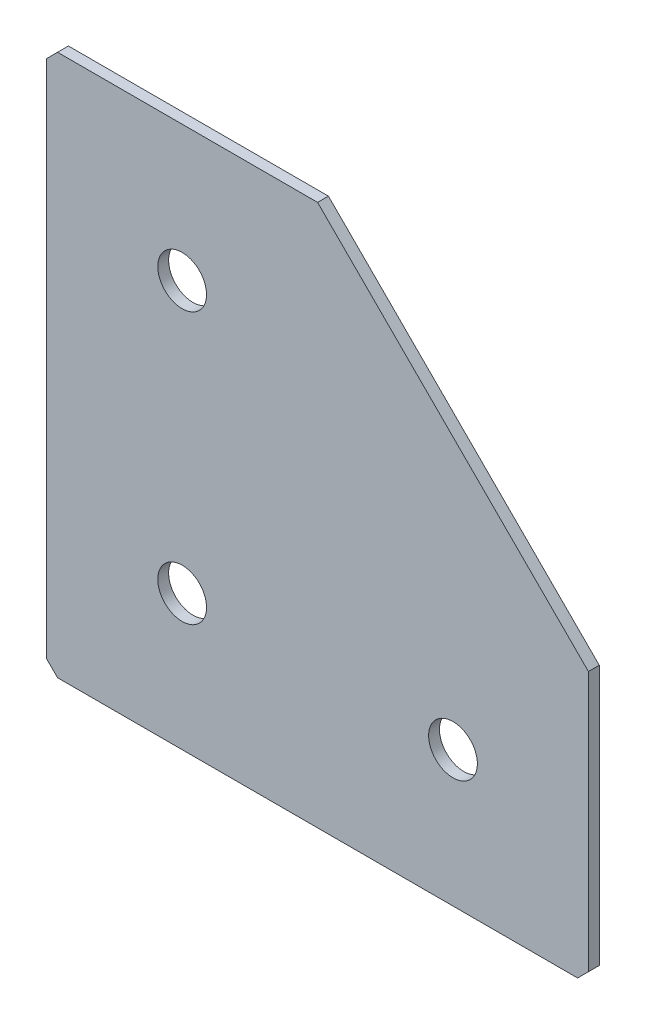
ISO-10303-21;
HEADER;
FILE_DESCRIPTION(('STEP AP214'),'2;1');
FILE_NAME('part.step','',(''),(''),'','','');
FILE_SCHEMA(('AUTOMOTIVE_DESIGN { 1 0 10303 214 1 1 1 1 }'));
ENDSEC;
DATA;
#1=APPLICATION_CONTEXT('core data for automotive mechanical design processes');
#2=APPLICATION_PROTOCOL_DEFINITION('international standard','automotive_design',2000,#1);
#3=PRODUCT_CONTEXT('',#1,'mechanical');
#4=PRODUCT('Part','Part','',(#3));
#5=PRODUCT_RELATED_PRODUCT_CATEGORY('part','',(#4));
#6=PRODUCT_DEFINITION_FORMATION('','',#4);
#7=PRODUCT_DEFINITION_CONTEXT('part definition',#1,'design');
#8=PRODUCT_DEFINITION('design','',#6,#7);
#9=PRODUCT_DEFINITION_SHAPE('','',#8);
#10=(LENGTH_UNIT() NAMED_UNIT(*) SI_UNIT(.MILLI.,.METRE.));
#11=(NAMED_UNIT(*) PLANE_ANGLE_UNIT() SI_UNIT($,.RADIAN.));
#12=(NAMED_UNIT(*) SI_UNIT($,.STERADIAN.) SOLID_ANGLE_UNIT());
#13=UNCERTAINTY_MEASURE_WITH_UNIT(LENGTH_MEASURE(1.E-05),#10,'distance_accuracy_value','');
#14=(GEOMETRIC_REPRESENTATION_CONTEXT(3) GLOBAL_UNCERTAINTY_ASSIGNED_CONTEXT((#13)) GLOBAL_UNIT_ASSIGNED_CONTEXT((#10,
#11,#12)) REPRESENTATION_CONTEXT('',''));
#15=CARTESIAN_POINT('',(0.,0.,0.));
#16=DIRECTION('',(0.,0.,1.));
#17=DIRECTION('',(1.,0.,0.));
#18=AXIS2_PLACEMENT_3D('',#15,#16,#17);
#19=CARTESIAN_POINT('',(50.,0.,-2.));
#20=DIRECTION('',(0.,-1.,0.));
#21=DIRECTION('',(1.,0.,0.));
#22=AXIS2_PLACEMENT_3D('',#19,#20,#21);
#23=PLANE('',#22);
#24=DIRECTION('',(1.,0.,0.));
#25=VECTOR('',#24,1.);
#26=CARTESIAN_POINT('',(50.,0.,-2.));
#27=LINE('',#26,#25);
#28=CARTESIAN_POINT('',(2.00000000000003,0.,-2.));
#29=VERTEX_POINT('',#28);
#30=CARTESIAN_POINT('',(50.,0.,-2.));
#31=VERTEX_POINT('',#30);
#32=EDGE_CURVE('E104',#29,#31,#27,.T.);
#33=ORIENTED_EDGE('',*,*,#32,.F.);
#34=DIRECTION('',(0.,0.,1.));
#35=VECTOR('',#34,1.);
#36=CARTESIAN_POINT('',(2.00000000000003,0.,-2.));
#37=LINE('',#36,#35);
#38=CARTESIAN_POINT('',(2.00000000000003,0.,0.));
#39=VERTEX_POINT('',#38);
#40=EDGE_CURVE('E133',#29,#39,#37,.T.);
#41=ORIENTED_EDGE('',*,*,#40,.T.);
#42=DIRECTION('',(1.,0.,0.));
#43=VECTOR('',#42,1.);
#44=CARTESIAN_POINT('',(50.,0.,0.));
#45=LINE('',#44,#43);
#46=CARTESIAN_POINT('',(50.,0.,0.));
#47=VERTEX_POINT('',#46);
#48=EDGE_CURVE('E130',#39,#47,#45,.T.);
#49=ORIENTED_EDGE('',*,*,#48,.T.);
#50=DIRECTION('',(0.,0.,1.));
#51=VECTOR('',#50,1.);
#52=CARTESIAN_POINT('',(50.,0.,-2.));
#53=LINE('',#52,#51);
#54=EDGE_CURVE('E122',#31,#47,#53,.T.);
#55=ORIENTED_EDGE('',*,*,#54,.F.);
#56=EDGE_LOOP('',(#33,#41,#49,#55));
#57=FACE_BOUND('',#56,.T.);
#58=ADVANCED_FACE('F39',(#57),#23,.F.);
#59=CARTESIAN_POINT('',(100.,-50.,-2.));
#60=DIRECTION('',(-0.707106781186547,-0.707106781186547,0.));
#61=DIRECTION('',(0.707106781186548,-0.707106781186548,0.));
#62=AXIS2_PLACEMENT_3D('',#59,#60,#61);
#63=PLANE('',#62);
#64=DIRECTION('',(0.707106781186547,-0.707106781186547,0.));
#65=VECTOR('',#64,1.);
#66=CARTESIAN_POINT('',(100.,-50.,0.));
#67=LINE('',#66,#65);
#68=CARTESIAN_POINT('',(100.,-50.,0.));
#69=VERTEX_POINT('',#68);
#70=EDGE_CURVE('E185',#47,#69,#67,.T.);
#71=ORIENTED_EDGE('',*,*,#70,.T.);
#72=DIRECTION('',(0.,0.,1.));
#73=VECTOR('',#72,1.);
#74=CARTESIAN_POINT('',(100.,-50.,-2.));
#75=LINE('',#74,#73);
#76=CARTESIAN_POINT('',(100.,-50.,-2.));
#77=VERTEX_POINT('',#76);
#78=EDGE_CURVE('E124',#77,#69,#75,.T.);
#79=ORIENTED_EDGE('',*,*,#78,.F.);
#80=DIRECTION('',(0.707106781186547,-0.707106781186547,0.));
#81=VECTOR('',#80,1.);
#82=CARTESIAN_POINT('',(100.,-50.,-2.));
#83=LINE('',#82,#81);
#84=EDGE_CURVE('E108',#31,#77,#83,.T.);
#85=ORIENTED_EDGE('',*,*,#84,.F.);
#86=ORIENTED_EDGE('',*,*,#54,.T.);
#87=EDGE_LOOP('',(#71,#79,#85,#86));
#88=FACE_BOUND('',#87,.T.);
#89=ADVANCED_FACE('F121',(#88),#63,.F.);
#90=CARTESIAN_POINT('',(100.,-100.,-2.));
#91=DIRECTION('',(-1.,0.,0.));
#92=DIRECTION('',(0.,0.,1.));
#93=AXIS2_PLACEMENT_3D('',#90,#91,#92);
#94=PLANE('',#93);
#95=DIRECTION('',(0.,-1.,0.));
#96=VECTOR('',#95,1.);
#97=CARTESIAN_POINT('',(100.,-100.,0.));
#98=LINE('',#97,#96);
#99=CARTESIAN_POINT('',(100.,-98.,0.));
#100=VERTEX_POINT('',#99);
#101=EDGE_CURVE('E180',#69,#100,#98,.T.);
#102=ORIENTED_EDGE('',*,*,#101,.T.);
#103=DIRECTION('',(0.,0.,-1.));
#104=VECTOR('',#103,1.);
#105=CARTESIAN_POINT('',(100.,-98.,-2.));
#106=LINE('',#105,#104);
#107=CARTESIAN_POINT('',(100.,-98.,-2.));
#108=VERTEX_POINT('',#107);
#109=EDGE_CURVE('E11',#100,#108,#106,.T.);
#110=ORIENTED_EDGE('',*,*,#109,.T.);
#111=DIRECTION('',(0.,-1.,0.));
#112=VECTOR('',#111,1.);
#113=CARTESIAN_POINT('',(100.,-100.,-2.));
#114=LINE('',#113,#112);
#115=EDGE_CURVE('E127',#77,#108,#114,.T.);
#116=ORIENTED_EDGE('',*,*,#115,.F.);
#117=ORIENTED_EDGE('',*,*,#78,.T.);
#118=EDGE_LOOP('',(#102,#110,#116,#117));
#119=FACE_BOUND('',#118,.T.);
#120=ADVANCED_FACE('F252',(#119),#94,.F.);
#121=CARTESIAN_POINT('',(0.,-100.,-2.));
#122=DIRECTION('',(0.,1.,0.));
#123=DIRECTION('',(0.,0.,1.));
#124=AXIS2_PLACEMENT_3D('',#121,#122,#123);
#125=PLANE('',#124);
#126=DIRECTION('',(-1.,0.,0.));
#127=VECTOR('',#126,1.);
#128=CARTESIAN_POINT('',(0.,-100.,-2.));
#129=LINE('',#128,#127);
#130=CARTESIAN_POINT('',(98.,-100.,-2.));
#131=VERTEX_POINT('',#130);
#132=CARTESIAN_POINT('',(2.,-100.,-2.));
#133=VERTEX_POINT('',#132);
#134=EDGE_CURVE('E172',#131,#133,#129,.T.);
#135=ORIENTED_EDGE('',*,*,#134,.F.);
#136=DIRECTION('',(0.,0.,1.));
#137=VECTOR('',#136,1.);
#138=CARTESIAN_POINT('',(98.,-100.,-2.));
#139=LINE('',#138,#137);
#140=CARTESIAN_POINT('',(98.,-100.,0.));
#141=VERTEX_POINT('',#140);
#142=EDGE_CURVE('E48',#131,#141,#139,.T.);
#143=ORIENTED_EDGE('',*,*,#142,.T.);
#144=DIRECTION('',(-1.,0.,0.));
#145=VECTOR('',#144,1.);
#146=CARTESIAN_POINT('',(0.,-100.,0.));
#147=LINE('',#146,#145);
#148=CARTESIAN_POINT('',(2.,-100.,0.));
#149=VERTEX_POINT('',#148);
#150=EDGE_CURVE('E171',#141,#149,#147,.T.);
#151=ORIENTED_EDGE('',*,*,#150,.T.);
#152=DIRECTION('',(0.,0.,-1.));
#153=VECTOR('',#152,1.);
#154=CARTESIAN_POINT('',(2.,-100.,-2.));
#155=LINE('',#154,#153);
#156=EDGE_CURVE('E55',#149,#133,#155,.T.);
#157=ORIENTED_EDGE('',*,*,#156,.T.);
#158=EDGE_LOOP('',(#135,#143,#151,#157));
#159=FACE_BOUND('',#158,.T.);
#160=ADVANCED_FACE('F170',(#159),#125,.F.);
#161=CARTESIAN_POINT('',(0.,0.,-2.));
#162=DIRECTION('',(1.,0.,0.));
#163=DIRECTION('',(0.,0.,-1.));
#164=AXIS2_PLACEMENT_3D('',#161,#162,#163);
#165=PLANE('',#164);
#166=DIRECTION('',(0.,1.,0.));
#167=VECTOR('',#166,1.);
#168=CARTESIAN_POINT('',(0.,0.,0.));
#169=LINE('',#168,#167);
#170=CARTESIAN_POINT('',(0.,-98.,0.));
#171=VERTEX_POINT('',#170);
#172=CARTESIAN_POINT('',(0.,-2.00000000000004,0.));
#173=VERTEX_POINT('',#172);
#174=EDGE_CURVE('E117',#171,#173,#169,.T.);
#175=ORIENTED_EDGE('',*,*,#174,.T.);
#176=DIRECTION('',(0.,0.,-1.));
#177=VECTOR('',#176,1.);
#178=CARTESIAN_POINT('',(0.,-2.00000000000004,-2.));
#179=LINE('',#178,#177);
#180=CARTESIAN_POINT('',(0.,-2.00000000000004,-2.));
#181=VERTEX_POINT('',#180);
#182=EDGE_CURVE('E155',#173,#181,#179,.T.);
#183=ORIENTED_EDGE('',*,*,#182,.T.);
#184=DIRECTION('',(0.,1.,0.));
#185=VECTOR('',#184,1.);
#186=CARTESIAN_POINT('',(0.,0.,-2.));
#187=LINE('',#186,#185);
#188=CARTESIAN_POINT('',(0.,-98.,-2.));
#189=VERTEX_POINT('',#188);
#190=EDGE_CURVE('E139',#189,#181,#187,.T.);
#191=ORIENTED_EDGE('',*,*,#190,.F.);
#192=DIRECTION('',(0.,0.,1.));
#193=VECTOR('',#192,1.);
#194=CARTESIAN_POINT('',(0.,-98.,-2.));
#195=LINE('',#194,#193);
#196=EDGE_CURVE('E151',#189,#171,#195,.T.);
#197=ORIENTED_EDGE('',*,*,#196,.T.);
#198=EDGE_LOOP('',(#175,#183,#191,#197));
#199=FACE_BOUND('',#198,.T.);
#200=ADVANCED_FACE('F227',(#199),#165,.F.);
#201=CARTESIAN_POINT('',(0.,0.,-2.));
#202=DIRECTION('',(0.,0.,1.));
#203=DIRECTION('',(1.,0.,0.));
#204=AXIS2_PLACEMENT_3D('',#201,#202,#203);
#205=PLANE('',#204);
#206=CARTESIAN_POINT('',(25.,-75.,-2.));
#207=DIRECTION('',(0.,0.,-1.));
#208=DIRECTION('',(0.,1.,0.));
#209=AXIS2_PLACEMENT_3D('',#206,#207,#208);
#210=CIRCLE('',#209,4.5);
#211=CARTESIAN_POINT('',(25.,-70.5,-2.));
#212=VERTEX_POINT('',#211);
#213=EDGE_CURVE('E218',#212,#212,#210,.T.);
#214=ORIENTED_EDGE('',*,*,#213,.F.);
#215=EDGE_LOOP('',(#214));
#216=FACE_BOUND('',#215,.T.);
#217=CARTESIAN_POINT('',(25.,-25.,-2.));
#218=DIRECTION('',(0.,0.,-1.));
#219=DIRECTION('',(0.,1.,0.));
#220=AXIS2_PLACEMENT_3D('',#217,#218,#219);
#221=CIRCLE('',#220,4.5);
#222=CARTESIAN_POINT('',(25.,-20.5,-2.));
#223=VERTEX_POINT('',#222);
#224=EDGE_CURVE('E210',#223,#223,#221,.T.);
#225=ORIENTED_EDGE('',*,*,#224,.F.);
#226=EDGE_LOOP('',(#225));
#227=FACE_BOUND('',#226,.T.);
#228=CARTESIAN_POINT('',(75.,-75.,-2.));
#229=DIRECTION('',(0.,0.,-1.));
#230=DIRECTION('',(0.,1.,0.));
#231=AXIS2_PLACEMENT_3D('',#228,#229,#230);
#232=CIRCLE('',#231,4.5);
#233=CARTESIAN_POINT('',(75.,-70.5,-2.));
#234=VERTEX_POINT('',#233);
#235=EDGE_CURVE('E202',#234,#234,#232,.T.);
#236=ORIENTED_EDGE('',*,*,#235,.F.);
#237=EDGE_LOOP('',(#236));
#238=FACE_BOUND('',#237,.T.);
#239=ORIENTED_EDGE('',*,*,#190,.T.);
#240=DIRECTION('',(-0.707106781186545,-0.70710678118655,0.));
#241=VECTOR('',#240,1.);
#242=CARTESIAN_POINT('',(2.00000000000003,0.,-2.));
#243=LINE('',#242,#241);
#244=EDGE_CURVE('E111',#181,#29,#243,.F.);
#245=ORIENTED_EDGE('',*,*,#244,.T.);
#246=ORIENTED_EDGE('',*,*,#32,.T.);
#247=ORIENTED_EDGE('',*,*,#84,.T.);
#248=ORIENTED_EDGE('',*,*,#115,.T.);
#249=DIRECTION('',(0.707106781186543,0.707106781186552,0.));
#250=VECTOR('',#249,1.);
#251=CARTESIAN_POINT('',(98.,-100.,-2.));
#252=LINE('',#251,#250);
#253=EDGE_CURVE('E62',#108,#131,#252,.F.);
#254=ORIENTED_EDGE('',*,*,#253,.T.);
#255=ORIENTED_EDGE('',*,*,#134,.T.);
#256=DIRECTION('',(0.707106781186552,-0.707106781186543,0.));
#257=VECTOR('',#256,1.);
#258=CARTESIAN_POINT('',(0.,-98.,-2.));
#259=LINE('',#258,#257);
#260=EDGE_CURVE('E158',#133,#189,#259,.F.);
#261=ORIENTED_EDGE('',*,*,#260,.T.);
#262=EDGE_LOOP('',(#239,#245,#246,#247,#248,#254,#255,#261));
#263=FACE_BOUND('',#262,.T.);
#264=ADVANCED_FACE('F107',(#216,#227,#238,#263),#205,.F.);
#265=CARTESIAN_POINT('',(0.,0.,0.));
#266=DIRECTION('',(0.,0.,1.));
#267=DIRECTION('',(1.,0.,0.));
#268=AXIS2_PLACEMENT_3D('',#265,#266,#267);
#269=PLANE('',#268);
#270=CARTESIAN_POINT('',(25.,-75.,0.));
#271=DIRECTION('',(0.,0.,-1.));
#272=DIRECTION('',(0.,1.,0.));
#273=AXIS2_PLACEMENT_3D('',#270,#271,#272);
#274=CIRCLE('',#273,4.5);
#275=CARTESIAN_POINT('',(25.,-70.5,0.));
#276=VERTEX_POINT('',#275);
#277=EDGE_CURVE('E214',#276,#276,#274,.T.);
#278=ORIENTED_EDGE('',*,*,#277,.T.);
#279=EDGE_LOOP('',(#278));
#280=FACE_BOUND('',#279,.T.);
#281=CARTESIAN_POINT('',(25.,-25.,0.));
#282=DIRECTION('',(0.,0.,-1.));
#283=DIRECTION('',(0.,1.,0.));
#284=AXIS2_PLACEMENT_3D('',#281,#282,#283);
#285=CIRCLE('',#284,4.5);
#286=CARTESIAN_POINT('',(25.,-20.5,0.));
#287=VERTEX_POINT('',#286);
#288=EDGE_CURVE('E206',#287,#287,#285,.T.);
#289=ORIENTED_EDGE('',*,*,#288,.T.);
#290=EDGE_LOOP('',(#289));
#291=FACE_BOUND('',#290,.T.);
#292=CARTESIAN_POINT('',(75.,-75.,0.));
#293=DIRECTION('',(0.,0.,-1.));
#294=DIRECTION('',(0.,1.,0.));
#295=AXIS2_PLACEMENT_3D('',#292,#293,#294);
#296=CIRCLE('',#295,4.5);
#297=CARTESIAN_POINT('',(75.,-70.5,0.));
#298=VERTEX_POINT('',#297);
#299=EDGE_CURVE('E192',#298,#298,#296,.T.);
#300=ORIENTED_EDGE('',*,*,#299,.T.);
#301=EDGE_LOOP('',(#300));
#302=FACE_BOUND('',#301,.T.);
#303=ORIENTED_EDGE('',*,*,#48,.F.);
#304=DIRECTION('',(0.707106781186545,0.70710678118655,0.));
#305=VECTOR('',#304,1.);
#306=CARTESIAN_POINT('',(1.00000000000002,-1.00000000000001,0.));
#307=LINE('',#306,#305);
#308=EDGE_CURVE('E148',#39,#173,#307,.F.);
#309=ORIENTED_EDGE('',*,*,#308,.T.);
#310=ORIENTED_EDGE('',*,*,#174,.F.);
#311=DIRECTION('',(-0.707106781186552,0.707106781186543,0.));
#312=VECTOR('',#311,1.);
#313=CARTESIAN_POINT('',(-49.,-49.0000000000007,0.));
#314=LINE('',#313,#312);
#315=EDGE_CURVE('E137',#171,#149,#314,.F.);
#316=ORIENTED_EDGE('',*,*,#315,.T.);
#317=ORIENTED_EDGE('',*,*,#150,.F.);
#318=DIRECTION('',(-0.707106781186543,-0.707106781186552,0.));
#319=VECTOR('',#318,1.);
#320=CARTESIAN_POINT('',(99.0000000000007,-98.9999999999993,0.));
#321=LINE('',#320,#319);
#322=EDGE_CURVE('E145',#141,#100,#321,.F.);
#323=ORIENTED_EDGE('',*,*,#322,.T.);
#324=ORIENTED_EDGE('',*,*,#101,.F.);
#325=ORIENTED_EDGE('',*,*,#70,.F.);
#326=EDGE_LOOP('',(#303,#309,#310,#316,#317,#323,#324,#325));
#327=FACE_BOUND('',#326,.T.);
#328=ADVANCED_FACE('F175',(#280,#291,#302,#327),#269,.T.);
#329=CARTESIAN_POINT('',(75.,-75.,-2.));
#330=DIRECTION('',(0.,0.,-1.));
#331=DIRECTION('',(0.,1.,0.));
#332=AXIS2_PLACEMENT_3D('',#329,#330,#331);
#333=CYLINDRICAL_SURFACE('',#332,4.5);
#334=ORIENTED_EDGE('',*,*,#299,.F.);
#335=EDGE_LOOP('',(#334));
#336=FACE_BOUND('',#335,.T.);
#337=ORIENTED_EDGE('',*,*,#235,.T.);
#338=EDGE_LOOP('',(#337));
#339=FACE_BOUND('',#338,.T.);
#340=ADVANCED_FACE('F233',(#336,#339),#333,.F.);
#341=CARTESIAN_POINT('',(25.,-25.,-2.));
#342=DIRECTION('',(0.,0.,-1.));
#343=DIRECTION('',(0.,1.,0.));
#344=AXIS2_PLACEMENT_3D('',#341,#342,#343);
#345=CYLINDRICAL_SURFACE('',#344,4.5);
#346=ORIENTED_EDGE('',*,*,#288,.F.);
#347=EDGE_LOOP('',(#346));
#348=FACE_BOUND('',#347,.T.);
#349=ORIENTED_EDGE('',*,*,#224,.T.);
#350=EDGE_LOOP('',(#349));
#351=FACE_BOUND('',#350,.T.);
#352=ADVANCED_FACE('F235',(#348,#351),#345,.F.);
#353=CARTESIAN_POINT('',(25.,-75.,-2.));
#354=DIRECTION('',(0.,0.,-1.));
#355=DIRECTION('',(0.,1.,0.));
#356=AXIS2_PLACEMENT_3D('',#353,#354,#355);
#357=CYLINDRICAL_SURFACE('',#356,4.5);
#358=ORIENTED_EDGE('',*,*,#277,.F.);
#359=EDGE_LOOP('',(#358));
#360=FACE_BOUND('',#359,.T.);
#361=ORIENTED_EDGE('',*,*,#213,.T.);
#362=EDGE_LOOP('',(#361));
#363=FACE_BOUND('',#362,.T.);
#364=ADVANCED_FACE('F223',(#360,#363),#357,.F.);
#365=CARTESIAN_POINT('',(2.00000000000003,0.,-2.));
#366=DIRECTION('',(0.70710678118655,-0.707106781186545,0.));
#367=DIRECTION('',(0.,0.,1.));
#368=AXIS2_PLACEMENT_3D('',#365,#366,#367);
#369=PLANE('',#368);
#370=ORIENTED_EDGE('',*,*,#244,.F.);
#371=ORIENTED_EDGE('',*,*,#182,.F.);
#372=ORIENTED_EDGE('',*,*,#308,.F.);
#373=ORIENTED_EDGE('',*,*,#40,.F.);
#374=EDGE_LOOP('',(#370,#371,#372,#373));
#375=FACE_BOUND('',#374,.T.);
#376=ADVANCED_FACE('F256',(#375),#369,.F.);
#377=CARTESIAN_POINT('',(98.,-100.,-2.));
#378=DIRECTION('',(-0.707106781186552,0.707106781186543,0.));
#379=DIRECTION('',(0.,0.,1.));
#380=AXIS2_PLACEMENT_3D('',#377,#378,#379);
#381=PLANE('',#380);
#382=ORIENTED_EDGE('',*,*,#253,.F.);
#383=ORIENTED_EDGE('',*,*,#109,.F.);
#384=ORIENTED_EDGE('',*,*,#322,.F.);
#385=ORIENTED_EDGE('',*,*,#142,.F.);
#386=EDGE_LOOP('',(#382,#383,#384,#385));
#387=FACE_BOUND('',#386,.T.);
#388=ADVANCED_FACE('F258',(#387),#381,.F.);
#389=CARTESIAN_POINT('',(0.,-98.,-2.));
#390=DIRECTION('',(0.707106781186543,0.707106781186552,0.));
#391=DIRECTION('',(0.,0.,1.));
#392=AXIS2_PLACEMENT_3D('',#389,#390,#391);
#393=PLANE('',#392);
#394=ORIENTED_EDGE('',*,*,#260,.F.);
#395=ORIENTED_EDGE('',*,*,#156,.F.);
#396=ORIENTED_EDGE('',*,*,#315,.F.);
#397=ORIENTED_EDGE('',*,*,#196,.F.);
#398=EDGE_LOOP('',(#394,#395,#396,#397));
#399=FACE_BOUND('',#398,.T.);
#400=ADVANCED_FACE('F41',(#399),#393,.F.);
#401=CLOSED_SHELL('',(#58,#89,#120,#160,#200,#264,#328,#340,#352,#364,#376,#388,#400));
#402=MANIFOLD_SOLID_BREP('B2',#401);
#403=ADVANCED_BREP_SHAPE_REPRESENTATION('',(#18,#402),#14);
#404=SHAPE_DEFINITION_REPRESENTATION(#9,#403);
ENDSEC;
END-ISO-10303-21;
